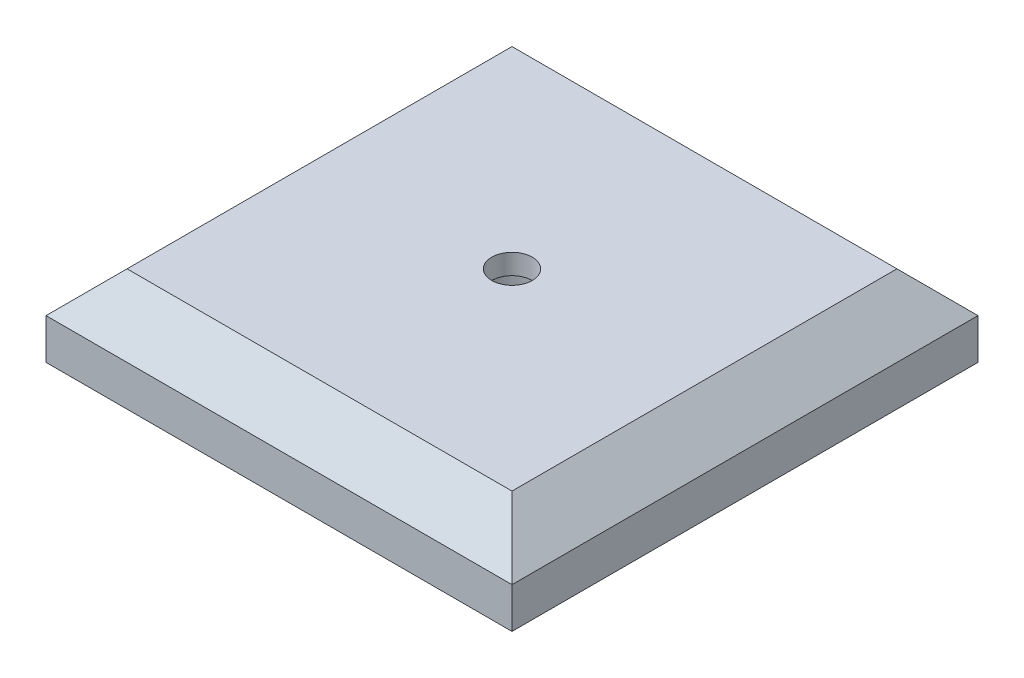
ISO-10303-21;
HEADER;
FILE_DESCRIPTION(('STEP AP214'),'2;1');
FILE_NAME('part.step','',(''),(''),'','','');
FILE_SCHEMA(('AUTOMOTIVE_DESIGN { 1 0 10303 214 1 1 1 1 }'));
ENDSEC;
DATA;
#1=APPLICATION_CONTEXT('core data for automotive mechanical design processes');
#2=APPLICATION_PROTOCOL_DEFINITION('international standard','automotive_design',2000,#1);
#3=PRODUCT_CONTEXT('',#1,'mechanical');
#4=PRODUCT('Part','Part','',(#3));
#5=PRODUCT_RELATED_PRODUCT_CATEGORY('part','',(#4));
#6=PRODUCT_DEFINITION_FORMATION('','',#4);
#7=PRODUCT_DEFINITION_CONTEXT('part definition',#1,'design');
#8=PRODUCT_DEFINITION('design','',#6,#7);
#9=PRODUCT_DEFINITION_SHAPE('','',#8);
#10=(LENGTH_UNIT() NAMED_UNIT(*) SI_UNIT(.MILLI.,.METRE.));
#11=(NAMED_UNIT(*) PLANE_ANGLE_UNIT() SI_UNIT($,.RADIAN.));
#12=(NAMED_UNIT(*) SI_UNIT($,.STERADIAN.) SOLID_ANGLE_UNIT());
#13=UNCERTAINTY_MEASURE_WITH_UNIT(LENGTH_MEASURE(1.E-05),#10,'distance_accuracy_value','');
#14=(GEOMETRIC_REPRESENTATION_CONTEXT(3) GLOBAL_UNCERTAINTY_ASSIGNED_CONTEXT((#13)) GLOBAL_UNIT_ASSIGNED_CONTEXT((#10,
#11,#12)) REPRESENTATION_CONTEXT('',''));
#15=CARTESIAN_POINT('',(0.,0.,0.));
#16=DIRECTION('',(0.,0.,1.));
#17=DIRECTION('',(1.,0.,0.));
#18=AXIS2_PLACEMENT_3D('',#15,#16,#17);
#19=CARTESIAN_POINT('',(14.375,5.,14.375));
#20=DIRECTION('',(-1.,0.,0.));
#21=DIRECTION('',(0.,0.,1.));
#22=AXIS2_PLACEMENT_3D('',#19,#20,#21);
#23=PLANE('',#22);
#24=DIRECTION('',(0.,-1.,0.));
#25=VECTOR('',#24,1.);
#26=CARTESIAN_POINT('',(14.375,5.,-14.375));
#27=LINE('',#26,#25);
#28=CARTESIAN_POINT('',(14.375,2.49999999999999,-14.375));
#29=VERTEX_POINT('',#28);
#30=CARTESIAN_POINT('',(14.375,0.,-14.375));
#31=VERTEX_POINT('',#30);
#32=EDGE_CURVE('E88',#29,#31,#27,.T.);
#33=ORIENTED_EDGE('',*,*,#32,.F.);
#34=DIRECTION('',(0.,0.,1.));
#35=VECTOR('',#34,1.);
#36=CARTESIAN_POINT('',(14.375,2.49999999999999,14.375));
#37=LINE('',#36,#35);
#38=CARTESIAN_POINT('',(14.375,2.49999999999999,14.375));
#39=VERTEX_POINT('',#38);
#40=EDGE_CURVE('E11',#29,#39,#37,.T.);
#41=ORIENTED_EDGE('',*,*,#40,.T.);
#42=DIRECTION('',(0.,-1.,0.));
#43=VECTOR('',#42,1.);
#44=CARTESIAN_POINT('',(14.375,5.,14.375));
#45=LINE('',#44,#43);
#46=CARTESIAN_POINT('',(14.375,0.,14.375));
#47=VERTEX_POINT('',#46);
#48=EDGE_CURVE('E108',#39,#47,#45,.T.);
#49=ORIENTED_EDGE('',*,*,#48,.T.);
#50=DIRECTION('',(0.,0.,-1.));
#51=VECTOR('',#50,1.);
#52=CARTESIAN_POINT('',(14.375,0.,14.375));
#53=LINE('',#52,#51);
#54=EDGE_CURVE('E103',#47,#31,#53,.T.);
#55=ORIENTED_EDGE('',*,*,#54,.T.);
#56=EDGE_LOOP('',(#33,#41,#49,#55));
#57=FACE_BOUND('',#56,.T.);
#58=ADVANCED_FACE('F35',(#57),#23,.F.);
#59=CARTESIAN_POINT('',(-14.375,5.,-14.375));
#60=DIRECTION('',(0.,0.,1.));
#61=DIRECTION('',(1.,0.,0.));
#62=AXIS2_PLACEMENT_3D('',#59,#60,#61);
#63=PLANE('',#62);
#64=DIRECTION('',(0.,-1.,0.));
#65=VECTOR('',#64,1.);
#66=CARTESIAN_POINT('',(-14.375,5.,-14.375));
#67=LINE('',#66,#65);
#68=CARTESIAN_POINT('',(-14.375,2.49999999999999,-14.375));
#69=VERTEX_POINT('',#68);
#70=CARTESIAN_POINT('',(-14.375,0.,-14.375));
#71=VERTEX_POINT('',#70);
#72=EDGE_CURVE('E97',#69,#71,#67,.T.);
#73=ORIENTED_EDGE('',*,*,#72,.F.);
#74=DIRECTION('',(1.,0.,0.));
#75=VECTOR('',#74,1.);
#76=CARTESIAN_POINT('',(-14.375,2.49999999999999,-14.375));
#77=LINE('',#76,#75);
#78=EDGE_CURVE('E45',#69,#29,#77,.T.);
#79=ORIENTED_EDGE('',*,*,#78,.T.);
#80=ORIENTED_EDGE('',*,*,#32,.T.);
#81=DIRECTION('',(-1.,0.,0.));
#82=VECTOR('',#81,1.);
#83=CARTESIAN_POINT('',(-14.375,0.,-14.375));
#84=LINE('',#83,#82);
#85=EDGE_CURVE('E91',#31,#71,#84,.T.);
#86=ORIENTED_EDGE('',*,*,#85,.T.);
#87=EDGE_LOOP('',(#73,#79,#80,#86));
#88=FACE_BOUND('',#87,.T.);
#89=ADVANCED_FACE('F90',(#88),#63,.F.);
#90=CARTESIAN_POINT('',(-14.375,5.,14.375));
#91=DIRECTION('',(1.,0.,0.));
#92=DIRECTION('',(0.,0.,-1.));
#93=AXIS2_PLACEMENT_3D('',#90,#91,#92);
#94=PLANE('',#93);
#95=DIRECTION('',(0.,-1.,0.));
#96=VECTOR('',#95,1.);
#97=CARTESIAN_POINT('',(-14.375,5.,14.375));
#98=LINE('',#97,#96);
#99=CARTESIAN_POINT('',(-14.375,2.49999999999999,14.375));
#100=VERTEX_POINT('',#99);
#101=CARTESIAN_POINT('',(-14.375,0.,14.375));
#102=VERTEX_POINT('',#101);
#103=EDGE_CURVE('E121',#100,#102,#98,.T.);
#104=ORIENTED_EDGE('',*,*,#103,.F.);
#105=DIRECTION('',(0.,0.,-1.));
#106=VECTOR('',#105,1.);
#107=CARTESIAN_POINT('',(-14.375,2.49999999999999,14.375));
#108=LINE('',#107,#106);
#109=EDGE_CURVE('E60',#100,#69,#108,.T.);
#110=ORIENTED_EDGE('',*,*,#109,.T.);
#111=ORIENTED_EDGE('',*,*,#72,.T.);
#112=DIRECTION('',(0.,0.,1.));
#113=VECTOR('',#112,1.);
#114=CARTESIAN_POINT('',(-14.375,0.,14.375));
#115=LINE('',#114,#113);
#116=EDGE_CURVE('E105',#71,#102,#115,.T.);
#117=ORIENTED_EDGE('',*,*,#116,.T.);
#118=EDGE_LOOP('',(#104,#110,#111,#117));
#119=FACE_BOUND('',#118,.T.);
#120=ADVANCED_FACE('F159',(#119),#94,.F.);
#121=CARTESIAN_POINT('',(-14.375,5.,14.375));
#122=DIRECTION('',(0.,0.,-1.));
#123=DIRECTION('',(-1.,0.,0.));
#124=AXIS2_PLACEMENT_3D('',#121,#122,#123);
#125=PLANE('',#124);
#126=ORIENTED_EDGE('',*,*,#48,.F.);
#127=DIRECTION('',(-1.,0.,0.));
#128=VECTOR('',#127,1.);
#129=CARTESIAN_POINT('',(-14.375,2.49999999999999,14.375));
#130=LINE('',#129,#128);
#131=EDGE_CURVE('E132',#39,#100,#130,.T.);
#132=ORIENTED_EDGE('',*,*,#131,.T.);
#133=ORIENTED_EDGE('',*,*,#103,.T.);
#134=DIRECTION('',(1.,0.,0.));
#135=VECTOR('',#134,1.);
#136=CARTESIAN_POINT('',(-14.375,0.,14.375));
#137=LINE('',#136,#135);
#138=EDGE_CURVE('E118',#102,#47,#137,.T.);
#139=ORIENTED_EDGE('',*,*,#138,.T.);
#140=EDGE_LOOP('',(#126,#132,#133,#139));
#141=FACE_BOUND('',#140,.T.);
#142=ADVANCED_FACE('F158',(#141),#125,.F.);
#143=CARTESIAN_POINT('',(0.,5.,0.));
#144=DIRECTION('',(0.,-1.,0.));
#145=DIRECTION('',(0.,0.,-1.));
#146=AXIS2_PLACEMENT_3D('',#143,#144,#145);
#147=PLANE('',#146);
#148=CARTESIAN_POINT('',(0.,5.,0.));
#149=DIRECTION('',(0.,1.,0.));
#150=DIRECTION('',(0.,0.,1.));
#151=AXIS2_PLACEMENT_3D('',#148,#149,#150);
#152=CIRCLE('',#151,1.25);
#153=CARTESIAN_POINT('',(0.,5.,1.25));
#154=VERTEX_POINT('',#153);
#155=EDGE_CURVE('E114',#154,#154,#152,.T.);
#156=ORIENTED_EDGE('',*,*,#155,.F.);
#157=EDGE_LOOP('',(#156));
#158=FACE_BOUND('',#157,.T.);
#159=DIRECTION('',(0.,0.,1.));
#160=VECTOR('',#159,1.);
#161=CARTESIAN_POINT('',(-11.875,5.,0.));
#162=LINE('',#161,#160);
#163=CARTESIAN_POINT('',(-11.875,5.,-11.875));
#164=VERTEX_POINT('',#163);
#165=CARTESIAN_POINT('',(-11.875,5.,11.875));
#166=VERTEX_POINT('',#165);
#167=EDGE_CURVE('E127',#164,#166,#162,.T.);
#168=ORIENTED_EDGE('',*,*,#167,.T.);
#169=DIRECTION('',(1.,0.,0.));
#170=VECTOR('',#169,1.);
#171=CARTESIAN_POINT('',(0.,5.,11.875));
#172=LINE('',#171,#170);
#173=CARTESIAN_POINT('',(11.875,5.,11.875));
#174=VERTEX_POINT('',#173);
#175=EDGE_CURVE('E129',#166,#174,#172,.T.);
#176=ORIENTED_EDGE('',*,*,#175,.T.);
#177=DIRECTION('',(0.,0.,-1.));
#178=VECTOR('',#177,1.);
#179=CARTESIAN_POINT('',(11.875,5.,0.));
#180=LINE('',#179,#178);
#181=CARTESIAN_POINT('',(11.875,5.,-11.875));
#182=VERTEX_POINT('',#181);
#183=EDGE_CURVE('E96',#174,#182,#180,.T.);
#184=ORIENTED_EDGE('',*,*,#183,.T.);
#185=DIRECTION('',(-1.,0.,0.));
#186=VECTOR('',#185,1.);
#187=CARTESIAN_POINT('',(0.,5.,-11.875));
#188=LINE('',#187,#186);
#189=EDGE_CURVE('E125',#182,#164,#188,.T.);
#190=ORIENTED_EDGE('',*,*,#189,.T.);
#191=EDGE_LOOP('',(#168,#176,#184,#190));
#192=FACE_BOUND('',#191,.T.);
#193=ADVANCED_FACE('F151',(#158,#192),#147,.F.);
#194=CARTESIAN_POINT('',(0.,0.,0.));
#195=DIRECTION('',(0.,-1.,0.));
#196=DIRECTION('',(0.,0.,-1.));
#197=AXIS2_PLACEMENT_3D('',#194,#195,#196);
#198=PLANE('',#197);
#199=CARTESIAN_POINT('',(0.,0.,0.));
#200=DIRECTION('',(0.,1.,0.));
#201=DIRECTION('',(0.,0.,1.));
#202=AXIS2_PLACEMENT_3D('',#199,#200,#201);
#203=CIRCLE('',#202,2.5);
#204=CARTESIAN_POINT('',(0.,0.,2.5));
#205=VERTEX_POINT('',#204);
#206=EDGE_CURVE('E224',#205,#205,#203,.T.);
#207=ORIENTED_EDGE('',*,*,#206,.T.);
#208=EDGE_LOOP('',(#207));
#209=FACE_BOUND('',#208,.T.);
#210=ORIENTED_EDGE('',*,*,#54,.F.);
#211=ORIENTED_EDGE('',*,*,#138,.F.);
#212=ORIENTED_EDGE('',*,*,#116,.F.);
#213=ORIENTED_EDGE('',*,*,#85,.F.);
#214=EDGE_LOOP('',(#210,#211,#212,#213));
#215=FACE_BOUND('',#214,.T.);
#216=ADVANCED_FACE('F101',(#209,#215),#198,.T.);
#217=CARTESIAN_POINT('',(0.,5.,-11.875));
#218=DIRECTION('',(0.,-0.707106781186547,0.707106781186549));
#219=DIRECTION('',(-1.,0.,0.));
#220=AXIS2_PLACEMENT_3D('',#217,#218,#219);
#221=PLANE('',#220);
#222=DIRECTION('',(-0.577350269189625,0.577350269189627,0.577350269189625));
#223=VECTOR('',#222,1.);
#224=CARTESIAN_POINT('',(7.91666666666668,8.95833333333334,-7.91666666666667));
#225=LINE('',#224,#223);
#226=EDGE_CURVE('E112',#29,#182,#225,.T.);
#227=ORIENTED_EDGE('',*,*,#226,.F.);
#228=ORIENTED_EDGE('',*,*,#78,.F.);
#229=DIRECTION('',(0.577350269189625,0.577350269189627,0.577350269189625));
#230=VECTOR('',#229,1.);
#231=CARTESIAN_POINT('',(-7.91666666666667,8.95833333333334,-7.91666666666667));
#232=LINE('',#231,#230);
#233=EDGE_CURVE('E40',#164,#69,#232,.F.);
#234=ORIENTED_EDGE('',*,*,#233,.F.);
#235=ORIENTED_EDGE('',*,*,#189,.F.);
#236=EDGE_LOOP('',(#227,#228,#234,#235));
#237=FACE_BOUND('',#236,.T.);
#238=ADVANCED_FACE('F38',(#237),#221,.F.);
#239=CARTESIAN_POINT('',(-11.875,5.,0.));
#240=DIRECTION('',(0.707106781186549,-0.707106781186547,0.));
#241=DIRECTION('',(0.,0.,1.));
#242=AXIS2_PLACEMENT_3D('',#239,#240,#241);
#243=PLANE('',#242);
#244=ORIENTED_EDGE('',*,*,#233,.T.);
#245=ORIENTED_EDGE('',*,*,#109,.F.);
#246=DIRECTION('',(0.577350269189625,0.577350269189627,-0.577350269189625));
#247=VECTOR('',#246,1.);
#248=CARTESIAN_POINT('',(-7.91666666666667,8.95833333333334,7.91666666666667));
#249=LINE('',#248,#247);
#250=EDGE_CURVE('E139',#166,#100,#249,.F.);
#251=ORIENTED_EDGE('',*,*,#250,.F.);
#252=ORIENTED_EDGE('',*,*,#167,.F.);
#253=EDGE_LOOP('',(#244,#245,#251,#252));
#254=FACE_BOUND('',#253,.T.);
#255=ADVANCED_FACE('F184',(#254),#243,.F.);
#256=CARTESIAN_POINT('',(11.875,5.,0.));
#257=DIRECTION('',(-0.707106781186549,-0.707106781186547,0.));
#258=DIRECTION('',(0.,0.,-1.));
#259=AXIS2_PLACEMENT_3D('',#256,#257,#258);
#260=PLANE('',#259);
#261=ORIENTED_EDGE('',*,*,#226,.T.);
#262=ORIENTED_EDGE('',*,*,#183,.F.);
#263=DIRECTION('',(0.577350269189625,-0.577350269189627,0.577350269189625));
#264=VECTOR('',#263,1.);
#265=CARTESIAN_POINT('',(7.91666666666668,8.95833333333334,7.91666666666667));
#266=LINE('',#265,#264);
#267=EDGE_CURVE('E137',#39,#174,#266,.F.);
#268=ORIENTED_EDGE('',*,*,#267,.F.);
#269=ORIENTED_EDGE('',*,*,#40,.F.);
#270=EDGE_LOOP('',(#261,#262,#268,#269));
#271=FACE_BOUND('',#270,.T.);
#272=ADVANCED_FACE('F144',(#271),#260,.F.);
#273=CARTESIAN_POINT('',(0.,5.,11.875));
#274=DIRECTION('',(0.,-0.707106781186547,-0.707106781186549));
#275=DIRECTION('',(1.,0.,0.));
#276=AXIS2_PLACEMENT_3D('',#273,#274,#275);
#277=PLANE('',#276);
#278=ORIENTED_EDGE('',*,*,#250,.T.);
#279=ORIENTED_EDGE('',*,*,#131,.F.);
#280=ORIENTED_EDGE('',*,*,#267,.T.);
#281=ORIENTED_EDGE('',*,*,#175,.F.);
#282=EDGE_LOOP('',(#278,#279,#280,#281));
#283=FACE_BOUND('',#282,.T.);
#284=ADVANCED_FACE('F155',(#283),#277,.F.);
#285=CARTESIAN_POINT('',(0.,3.75,0.));
#286=DIRECTION('',(0.,1.,0.));
#287=DIRECTION('',(0.,0.,1.));
#288=AXIS2_PLACEMENT_3D('',#285,#286,#287);
#289=CYLINDRICAL_SURFACE('',#288,1.25);
#290=CARTESIAN_POINT('',(0.,3.75,0.));
#291=DIRECTION('',(0.,1.,0.));
#292=DIRECTION('',(0.,0.,1.));
#293=AXIS2_PLACEMENT_3D('',#290,#291,#292);
#294=CIRCLE('',#293,1.25);
#295=CARTESIAN_POINT('',(0.,3.75,1.25));
#296=VERTEX_POINT('',#295);
#297=EDGE_CURVE('E219',#296,#296,#294,.T.);
#298=ORIENTED_EDGE('',*,*,#297,.F.);
#299=EDGE_LOOP('',(#298));
#300=FACE_BOUND('',#299,.T.);
#301=ORIENTED_EDGE('',*,*,#155,.T.);
#302=EDGE_LOOP('',(#301));
#303=FACE_BOUND('',#302,.T.);
#304=ADVANCED_FACE('F179',(#300,#303),#289,.F.);
#305=CARTESIAN_POINT('',(0.,0.,0.));
#306=DIRECTION('',(0.,1.,0.));
#307=DIRECTION('',(0.,0.,1.));
#308=AXIS2_PLACEMENT_3D('',#305,#306,#307);
#309=CYLINDRICAL_SURFACE('',#308,2.5);
#310=ORIENTED_EDGE('',*,*,#206,.F.);
#311=EDGE_LOOP('',(#310));
#312=FACE_BOUND('',#311,.T.);
#313=CARTESIAN_POINT('',(0.,3.75,0.));
#314=DIRECTION('',(0.,1.,0.));
#315=DIRECTION('',(0.,0.,1.));
#316=AXIS2_PLACEMENT_3D('',#313,#314,#315);
#317=CIRCLE('',#316,2.5);
#318=CARTESIAN_POINT('',(0.,3.75,2.5));
#319=VERTEX_POINT('',#318);
#320=EDGE_CURVE('E222',#319,#319,#317,.T.);
#321=ORIENTED_EDGE('',*,*,#320,.T.);
#322=EDGE_LOOP('',(#321));
#323=FACE_BOUND('',#322,.T.);
#324=ADVANCED_FACE('F206',(#312,#323),#309,.F.);
#325=CARTESIAN_POINT('',(0.,3.75,0.));
#326=DIRECTION('',(0.,1.,0.));
#327=DIRECTION('',(0.,0.,1.));
#328=AXIS2_PLACEMENT_3D('',#325,#326,#327);
#329=PLANE('',#328);
#330=ORIENTED_EDGE('',*,*,#297,.T.);
#331=EDGE_LOOP('',(#330));
#332=FACE_BOUND('',#331,.T.);
#333=ORIENTED_EDGE('',*,*,#320,.F.);
#334=EDGE_LOOP('',(#333));
#335=FACE_BOUND('',#334,.T.);
#336=ADVANCED_FACE('F210',(#332,#335),#329,.F.);
#337=CLOSED_SHELL('',(#58,#89,#120,#142,#193,#216,#238,#255,#272,#284,#304,#324,#336));
#338=MANIFOLD_SOLID_BREP('B2',#337);
#339=ADVANCED_BREP_SHAPE_REPRESENTATION('',(#18,#338),#14);
#340=SHAPE_DEFINITION_REPRESENTATION(#9,#339);
ENDSEC;
END-ISO-10303-21;
